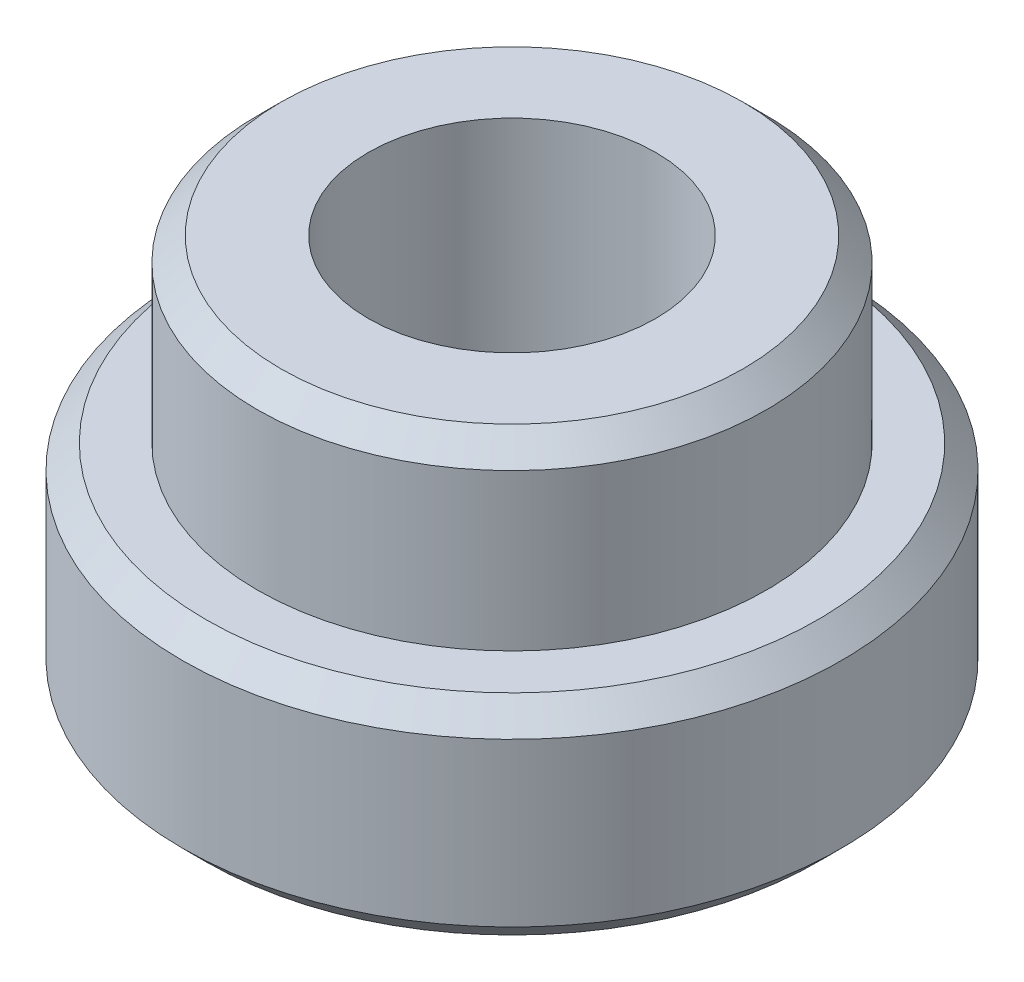
ISO-10303-21;
HEADER;
FILE_DESCRIPTION(('STEP AP214'),'2;1');
FILE_NAME('part.step','',(''),(''),'','','');
FILE_SCHEMA(('AUTOMOTIVE_DESIGN { 1 0 10303 214 1 1 1 1 }'));
ENDSEC;
DATA;
#1=APPLICATION_CONTEXT('core data for automotive mechanical design processes');
#2=APPLICATION_PROTOCOL_DEFINITION('international standard','automotive_design',2000,#1);
#3=PRODUCT_CONTEXT('',#1,'mechanical');
#4=PRODUCT('Part','Part','',(#3));
#5=PRODUCT_RELATED_PRODUCT_CATEGORY('part','',(#4));
#6=PRODUCT_DEFINITION_FORMATION('','',#4);
#7=PRODUCT_DEFINITION_CONTEXT('part definition',#1,'design');
#8=PRODUCT_DEFINITION('design','',#6,#7);
#9=PRODUCT_DEFINITION_SHAPE('','',#8);
#10=(LENGTH_UNIT() NAMED_UNIT(*) SI_UNIT(.MILLI.,.METRE.));
#11=(NAMED_UNIT(*) PLANE_ANGLE_UNIT() SI_UNIT($,.RADIAN.));
#12=(NAMED_UNIT(*) SI_UNIT($,.STERADIAN.) SOLID_ANGLE_UNIT());
#13=UNCERTAINTY_MEASURE_WITH_UNIT(LENGTH_MEASURE(1.E-05),#10,'distance_accuracy_value','');
#14=(GEOMETRIC_REPRESENTATION_CONTEXT(3) GLOBAL_UNCERTAINTY_ASSIGNED_CONTEXT((#13)) GLOBAL_UNIT_ASSIGNED_CONTEXT((#10,
#11,#12)) REPRESENTATION_CONTEXT('',''));
#15=CARTESIAN_POINT('',(0.,0.,0.));
#16=DIRECTION('',(0.,0.,1.));
#17=DIRECTION('',(1.,0.,0.));
#18=AXIS2_PLACEMENT_3D('',#15,#16,#17);
#19=CARTESIAN_POINT('',(0.,1.778,0.));
#20=DIRECTION('',(0.,-1.,0.));
#21=DIRECTION('',(0.,0.,-1.));
#22=AXIS2_PLACEMENT_3D('',#19,#20,#21);
#23=CYLINDRICAL_SURFACE('',#22,2.794);
#24=CARTESIAN_POINT('',(0.,1.578,0.));
#25=DIRECTION('',(0.,1.,0.));
#26=DIRECTION('',(0.,0.,1.));
#27=AXIS2_PLACEMENT_3D('',#24,#25,#26);
#28=CIRCLE('',#27,2.794);
#29=CARTESIAN_POINT('',(0.,1.578,2.794));
#30=VERTEX_POINT('',#29);
#31=EDGE_CURVE('E54',#30,#30,#28,.F.);
#32=ORIENTED_EDGE('',*,*,#31,.T.);
#33=EDGE_LOOP('',(#32));
#34=FACE_BOUND('',#33,.T.);
#35=CARTESIAN_POINT('',(0.,0.199999999999999,0.));
#36=DIRECTION('',(0.,1.,0.));
#37=DIRECTION('',(0.,0.,1.));
#38=AXIS2_PLACEMENT_3D('',#35,#36,#37);
#39=CIRCLE('',#38,2.794);
#40=CARTESIAN_POINT('',(0.,0.199999999999999,2.794));
#41=VERTEX_POINT('',#40);
#42=EDGE_CURVE('E57',#41,#41,#39,.T.);
#43=ORIENTED_EDGE('',*,*,#42,.T.);
#44=EDGE_LOOP('',(#43));
#45=FACE_BOUND('',#44,.T.);
#46=ADVANCED_FACE('F34',(#34,#45),#23,.T.);
#47=CARTESIAN_POINT('',(0.,1.778,0.));
#48=DIRECTION('',(0.,1.,0.));
#49=DIRECTION('',(0.,0.,1.));
#50=AXIS2_PLACEMENT_3D('',#47,#48,#49);
#51=PLANE('',#50);
#52=CARTESIAN_POINT('',(0.,1.778,0.));
#53=DIRECTION('',(0.,1.,0.));
#54=DIRECTION('',(0.,0.,1.));
#55=AXIS2_PLACEMENT_3D('',#52,#53,#54);
#56=CIRCLE('',#55,2.159);
#57=CARTESIAN_POINT('',(0.,1.778,2.159));
#58=VERTEX_POINT('',#57);
#59=EDGE_CURVE('E45',#58,#58,#56,.T.);
#60=ORIENTED_EDGE('',*,*,#59,.F.);
#61=EDGE_LOOP('',(#60));
#62=FACE_BOUND('',#61,.T.);
#63=CARTESIAN_POINT('',(0.,1.778,0.));
#64=DIRECTION('',(0.,1.,0.));
#65=DIRECTION('',(0.,0.,1.));
#66=AXIS2_PLACEMENT_3D('',#63,#64,#65);
#67=CIRCLE('',#66,2.594);
#68=CARTESIAN_POINT('',(0.,1.778,2.594));
#69=VERTEX_POINT('',#68);
#70=EDGE_CURVE('E60',#69,#69,#67,.T.);
#71=ORIENTED_EDGE('',*,*,#70,.T.);
#72=EDGE_LOOP('',(#71));
#73=FACE_BOUND('',#72,.T.);
#74=ADVANCED_FACE('F91',(#62,#73),#51,.T.);
#75=CARTESIAN_POINT('',(0.,0.,0.));
#76=DIRECTION('',(0.,1.,0.));
#77=DIRECTION('',(0.,0.,1.));
#78=AXIS2_PLACEMENT_3D('',#75,#76,#77);
#79=PLANE('',#78);
#80=CARTESIAN_POINT('',(0.,0.,0.));
#81=DIRECTION('',(0.,1.,0.));
#82=DIRECTION('',(0.,0.,1.));
#83=AXIS2_PLACEMENT_3D('',#80,#81,#82);
#84=CIRCLE('',#83,1.2192);
#85=CARTESIAN_POINT('',(0.,0.,1.2192));
#86=VERTEX_POINT('',#85);
#87=EDGE_CURVE('E62',#86,#86,#84,.T.);
#88=ORIENTED_EDGE('',*,*,#87,.T.);
#89=EDGE_LOOP('',(#88));
#90=FACE_BOUND('',#89,.T.);
#91=CARTESIAN_POINT('',(0.,0.,0.));
#92=DIRECTION('',(0.,1.,0.));
#93=DIRECTION('',(0.,0.,1.));
#94=AXIS2_PLACEMENT_3D('',#91,#92,#93);
#95=CIRCLE('',#94,2.594);
#96=CARTESIAN_POINT('',(0.,0.,2.594));
#97=VERTEX_POINT('',#96);
#98=EDGE_CURVE('E49',#97,#97,#95,.F.);
#99=ORIENTED_EDGE('',*,*,#98,.T.);
#100=EDGE_LOOP('',(#99));
#101=FACE_BOUND('',#100,.T.);
#102=ADVANCED_FACE('F70',(#90,#101),#79,.F.);
#103=CARTESIAN_POINT('',(0.,1.778,0.));
#104=DIRECTION('',(0.,-1.,0.));
#105=DIRECTION('',(0.,0.,-1.));
#106=AXIS2_PLACEMENT_3D('',#103,#104,#105);
#107=CONICAL_SURFACE('',#106,2.594,0.785398163397444);
#108=ORIENTED_EDGE('',*,*,#31,.F.);
#109=EDGE_LOOP('',(#108));
#110=FACE_BOUND('',#109,.T.);
#111=ORIENTED_EDGE('',*,*,#70,.F.);
#112=EDGE_LOOP('',(#111));
#113=FACE_BOUND('',#112,.T.);
#114=ADVANCED_FACE('F102',(#110,#113),#107,.T.);
#115=CARTESIAN_POINT('',(0.,0.199999999999999,0.));
#116=DIRECTION('',(0.,1.,0.));
#117=DIRECTION('',(0.,0.,1.));
#118=AXIS2_PLACEMENT_3D('',#115,#116,#117);
#119=CONICAL_SURFACE('',#118,2.794,0.78539816339745);
#120=ORIENTED_EDGE('',*,*,#98,.F.);
#121=EDGE_LOOP('',(#120));
#122=FACE_BOUND('',#121,.T.);
#123=ORIENTED_EDGE('',*,*,#42,.F.);
#124=EDGE_LOOP('',(#123));
#125=FACE_BOUND('',#124,.T.);
#126=ADVANCED_FACE('F88',(#122,#125),#119,.T.);
#127=CARTESIAN_POINT('',(0.,3.302,0.));
#128=DIRECTION('',(0.,-1.,0.));
#129=DIRECTION('',(0.,0.,-1.));
#130=AXIS2_PLACEMENT_3D('',#127,#128,#129);
#131=CYLINDRICAL_SURFACE('',#130,2.159);
#132=CARTESIAN_POINT('',(0.,3.10200000000001,0.));
#133=DIRECTION('',(0.,1.,0.));
#134=DIRECTION('',(0.,0.,1.));
#135=AXIS2_PLACEMENT_3D('',#132,#133,#134);
#136=CIRCLE('',#135,2.159);
#137=CARTESIAN_POINT('',(0.,3.10200000000001,2.159));
#138=VERTEX_POINT('',#137);
#139=EDGE_CURVE('E10',#138,#138,#136,.F.);
#140=ORIENTED_EDGE('',*,*,#139,.T.);
#141=EDGE_LOOP('',(#140));
#142=FACE_BOUND('',#141,.T.);
#143=ORIENTED_EDGE('',*,*,#59,.T.);
#144=EDGE_LOOP('',(#143));
#145=FACE_BOUND('',#144,.T.);
#146=ADVANCED_FACE('F81',(#142,#145),#131,.T.);
#147=CARTESIAN_POINT('',(0.,3.302,0.));
#148=DIRECTION('',(0.,1.,0.));
#149=DIRECTION('',(0.,0.,1.));
#150=AXIS2_PLACEMENT_3D('',#147,#148,#149);
#151=PLANE('',#150);
#152=CARTESIAN_POINT('',(0.,3.302,0.));
#153=DIRECTION('',(0.,1.,0.));
#154=DIRECTION('',(0.,0.,1.));
#155=AXIS2_PLACEMENT_3D('',#152,#153,#154);
#156=CIRCLE('',#155,1.2192);
#157=CARTESIAN_POINT('',(0.,3.302,1.2192));
#158=VERTEX_POINT('',#157);
#159=EDGE_CURVE('E64',#158,#158,#156,.T.);
#160=ORIENTED_EDGE('',*,*,#159,.F.);
#161=EDGE_LOOP('',(#160));
#162=FACE_BOUND('',#161,.T.);
#163=CARTESIAN_POINT('',(0.,3.302,0.));
#164=DIRECTION('',(0.,1.,0.));
#165=DIRECTION('',(0.,0.,1.));
#166=AXIS2_PLACEMENT_3D('',#163,#164,#165);
#167=CIRCLE('',#166,1.95900000000001);
#168=CARTESIAN_POINT('',(0.,3.302,1.95900000000001));
#169=VERTEX_POINT('',#168);
#170=EDGE_CURVE('E41',#169,#169,#167,.T.);
#171=ORIENTED_EDGE('',*,*,#170,.T.);
#172=EDGE_LOOP('',(#171));
#173=FACE_BOUND('',#172,.T.);
#174=ADVANCED_FACE('F79',(#162,#173),#151,.T.);
#175=CARTESIAN_POINT('',(0.,3.302,0.));
#176=DIRECTION('',(0.,-1.,0.));
#177=DIRECTION('',(0.,0.,-1.));
#178=AXIS2_PLACEMENT_3D('',#175,#176,#177);
#179=CONICAL_SURFACE('',#178,1.95900000000001,0.785398163397445);
#180=ORIENTED_EDGE('',*,*,#139,.F.);
#181=EDGE_LOOP('',(#180));
#182=FACE_BOUND('',#181,.T.);
#183=ORIENTED_EDGE('',*,*,#170,.F.);
#184=EDGE_LOOP('',(#183));
#185=FACE_BOUND('',#184,.T.);
#186=ADVANCED_FACE('F36',(#182,#185),#179,.T.);
#187=CARTESIAN_POINT('',(0.,0.,0.));
#188=DIRECTION('',(0.,1.,0.));
#189=DIRECTION('',(0.,0.,1.));
#190=AXIS2_PLACEMENT_3D('',#187,#188,#189);
#191=CYLINDRICAL_SURFACE('',#190,1.2192);
#192=ORIENTED_EDGE('',*,*,#87,.F.);
#193=EDGE_LOOP('',(#192));
#194=FACE_BOUND('',#193,.T.);
#195=ORIENTED_EDGE('',*,*,#159,.T.);
#196=EDGE_LOOP('',(#195));
#197=FACE_BOUND('',#196,.T.);
#198=ADVANCED_FACE('F73',(#194,#197),#191,.F.);
#199=CLOSED_SHELL('',(#46,#74,#102,#114,#126,#146,#174,#186,#198));
#200=MANIFOLD_SOLID_BREP('B2',#199);
#201=ADVANCED_BREP_SHAPE_REPRESENTATION('',(#18,#200),#14);
#202=SHAPE_DEFINITION_REPRESENTATION(#9,#201);
ENDSEC;
END-ISO-10303-21;
